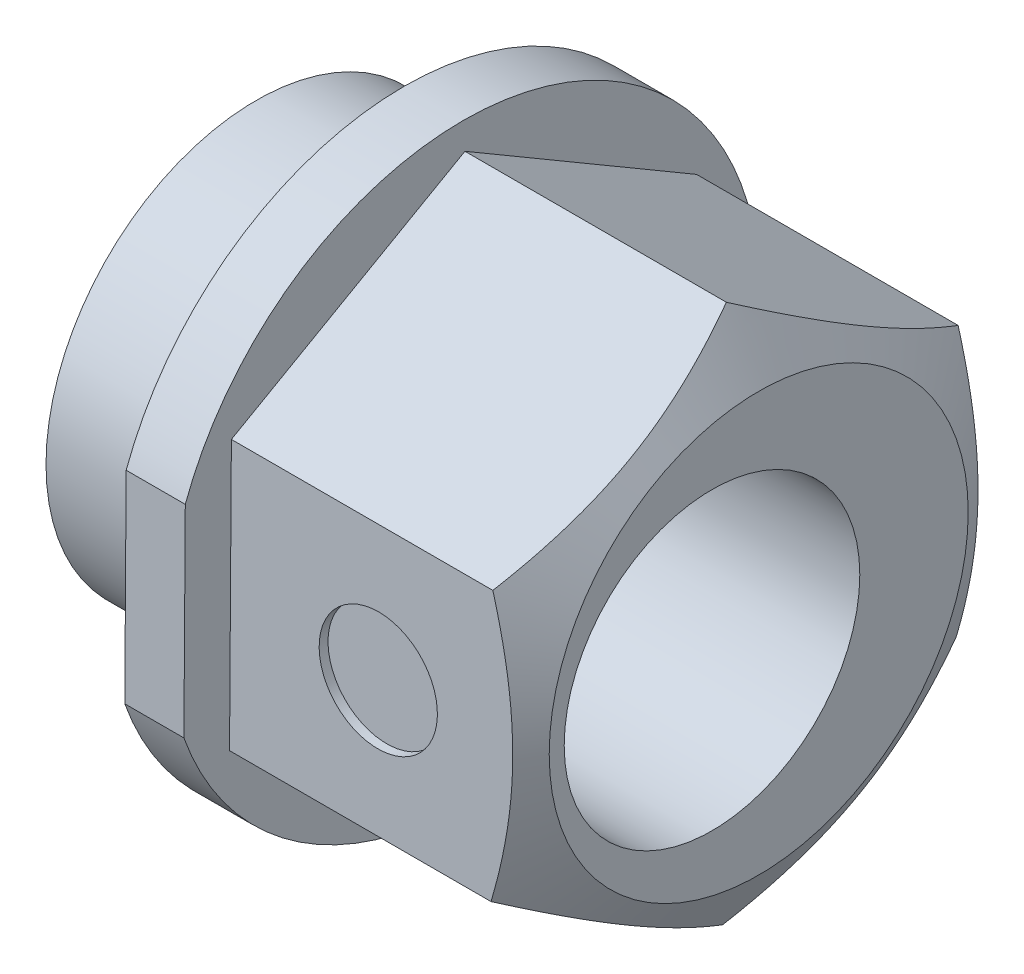
ISO-10303-21;
HEADER;
FILE_DESCRIPTION(('STEP AP214'),'2;1');
FILE_NAME('part.step','',(''),(''),'','','');
FILE_SCHEMA(('AUTOMOTIVE_DESIGN { 1 0 10303 214 1 1 1 1 }'));
ENDSEC;
DATA;
#1=APPLICATION_CONTEXT('core data for automotive mechanical design processes');
#2=APPLICATION_PROTOCOL_DEFINITION('international standard','automotive_design',2000,#1);
#3=PRODUCT_CONTEXT('',#1,'mechanical');
#4=PRODUCT('Part','Part','',(#3));
#5=PRODUCT_RELATED_PRODUCT_CATEGORY('part','',(#4));
#6=PRODUCT_DEFINITION_FORMATION('','',#4);
#7=PRODUCT_DEFINITION_CONTEXT('part definition',#1,'design');
#8=PRODUCT_DEFINITION('design','',#6,#7);
#9=PRODUCT_DEFINITION_SHAPE('','',#8);
#10=(LENGTH_UNIT() NAMED_UNIT(*) SI_UNIT(.MILLI.,.METRE.));
#11=(NAMED_UNIT(*) PLANE_ANGLE_UNIT() SI_UNIT($,.RADIAN.));
#12=(NAMED_UNIT(*) SI_UNIT($,.STERADIAN.) SOLID_ANGLE_UNIT());
#13=UNCERTAINTY_MEASURE_WITH_UNIT(LENGTH_MEASURE(1.E-05),#10,'distance_accuracy_value','');
#14=(GEOMETRIC_REPRESENTATION_CONTEXT(3) GLOBAL_UNCERTAINTY_ASSIGNED_CONTEXT((#13)) GLOBAL_UNIT_ASSIGNED_CONTEXT((#10,
#11,#12)) REPRESENTATION_CONTEXT('',''));
#15=CARTESIAN_POINT('',(0.,0.,0.));
#16=DIRECTION('',(0.,0.,1.));
#17=DIRECTION('',(1.,0.,0.));
#18=AXIS2_PLACEMENT_3D('',#15,#16,#17);
#19=CARTESIAN_POINT('',(5.,-4.54364126029758,0.0309423828233433));
#20=DIRECTION('',(0.,0.869410264297968,0.494090874569989));
#21=DIRECTION('',(0.,-0.494090874569989,0.869410264297968));
#22=AXIS2_PLACEMENT_3D('',#19,#20,#21);
#23=PLANE('',#22);
#24=DIRECTION('',(0.,0.494090874569989,-0.869410264297968));
#25=VECTOR('',#24,1.);
#26=CARTESIAN_POINT('',(4.42264973081037,-4.54364126029758,0.0309423828233433));
#27=LINE('',#26,#25);
#28=CARTESIAN_POINT('',(4.42264973081037,-4.54364126029758,0.0309423828233433));
#29=VERTEX_POINT('',#28);
#30=CARTESIAN_POINT('',(4.42264973081037,-4.54353714360121,0.0307591774067414));
#31=VERTEX_POINT('',#30);
#32=EDGE_CURVE('E233',#29,#31,#27,.T.);
#33=ORIENTED_EDGE('',*,*,#32,.F.);
#34=DIRECTION('',(-1.,0.,0.));
#35=VECTOR('',#34,1.);
#36=CARTESIAN_POINT('',(5.,-4.54364126029758,0.0309423828233433));
#37=LINE('',#36,#35);
#38=CARTESIAN_POINT('',(0.,-4.54364126029758,0.0309423828233433));
#39=VERTEX_POINT('',#38);
#40=EDGE_CURVE('E56',#29,#39,#37,.T.);
#41=ORIENTED_EDGE('',*,*,#40,.T.);
#42=DIRECTION('',(0.,0.494090874569989,-0.869410264297968));
#43=VECTOR('',#42,1.);
#44=CARTESIAN_POINT('',(0.,-4.54364126029758,0.0309423828233433));
#45=LINE('',#44,#43);
#46=CARTESIAN_POINT('',(0.,-2.29861751972745,-3.91943756568916));
#47=VERTEX_POINT('',#46);
#48=EDGE_CURVE('E286',#39,#47,#45,.T.);
#49=ORIENTED_EDGE('',*,*,#48,.T.);
#50=DIRECTION('',(-1.,0.,0.));
#51=VECTOR('',#50,1.);
#52=CARTESIAN_POINT('',(5.,-2.29861751972745,-3.91943756568916));
#53=LINE('',#52,#51);
#54=CARTESIAN_POINT('',(4.42264973081037,-2.29861751972745,-3.91943756568916));
#55=VERTEX_POINT('',#54);
#56=EDGE_CURVE('E255',#55,#47,#53,.T.);
#57=ORIENTED_EDGE('',*,*,#56,.F.);
#58=CARTESIAN_POINT('',(4.42264973081037,-2.29872163642382,-3.91925436027257));
#59=VERTEX_POINT('',#58);
#60=EDGE_CURVE('E235',#59,#55,#27,.T.);
#61=ORIENTED_EDGE('',*,*,#60,.F.);
#62=CARTESIAN_POINT('',(4.42252249257501,-4.5437549214527,0.0311423828233432));
#63=CARTESIAN_POINT('',(4.48018446189932,-4.44509780626388,-0.14245626674864));
#64=CARTESIAN_POINT('',(4.53262583823013,-4.34558908849139,-0.317553409948927));
#65=CARTESIAN_POINT('',(4.62416259753298,-4.14484856970296,-0.670779661389111));
#66=CARTESIAN_POINT('',(4.66322559849631,-4.04361320191933,-0.848915045770918));
#67=CARTESIAN_POINT('',(4.72403259166471,-3.84239708311443,-1.20297817066354));
#68=CARTESIAN_POINT('',(4.74618129094458,-3.74244729091028,-1.3788514355409));
#69=CARTESIAN_POINT('',(4.7726217929783,-3.54207742961478,-1.73142547208403));
#70=CARTESIAN_POINT('',(4.77693549121705,-3.4416580887709,-1.90812496231382));
#71=CARTESIAN_POINT('',(4.76795954206539,-3.2540203419231,-2.23829536511916));
#72=CARTESIAN_POINT('',(4.75687379404681,-3.16677384146384,-2.39181571315104));
#73=CARTESIAN_POINT('',(4.72173908945207,-2.99284924852408,-2.69785622937647));
#74=CARTESIAN_POINT('',(4.69767813181348,-2.90617175757552,-2.85037533910474));
#75=CARTESIAN_POINT('',(4.6375278388602,-2.73188859059485,-3.15704680799033));
#76=CARTESIAN_POINT('',(4.60118353864082,-2.64430497189952,-3.31116035470246));
#77=CARTESIAN_POINT('',(4.51869636125273,-2.47044399379805,-3.61708893323339));
#78=CARTESIAN_POINT('',(4.47257286465198,-2.3841644071245,-3.76890788418783));
#79=CARTESIAN_POINT('',(4.42252249257501,-2.29850385857233,-3.91963756568916));
#80=B_SPLINE_CURVE_WITH_KNOTS('',3,(#62,#63,#64,#65,#66,#67,#68,#69,#70,#71,#72,#73,#74,#75,#76,
#77,#78,#79),.UNSPECIFIED.,.F.,.F.,(4,2,2,2,2,2,2,2,4),(0.,0.62374475376447,1.24898876839455,
1.85875839446027,2.46777920233101,2.99805711762561,3.52882634219932,4.07136862541339,
4.61284557540261),.UNSPECIFIED.);
#81=EDGE_CURVE('E206',#31,#59,#80,.T.);
#82=ORIENTED_EDGE('',*,*,#81,.F.);
#83=EDGE_LOOP('',(#33,#41,#49,#57,#61,#82));
#84=FACE_BOUND('',#83,.T.);
#85=ADVANCED_FACE('F33',(#84),#23,.F.);
#86=CARTESIAN_POINT('',(5.,-2.29861751972745,-3.91943756568916));
#87=DIRECTION('',(0.,0.00680988299330266,0.999976812477978));
#88=DIRECTION('',(0.,-0.999976812477978,0.00680988299330266));
#89=AXIS2_PLACEMENT_3D('',#86,#87,#88);
#90=PLANE('',#89);
#91=DIRECTION('',(0.,0.999976812477978,-0.00680988299330266));
#92=VECTOR('',#91,1.);
#93=CARTESIAN_POINT('',(4.42264973081037,-2.29861751972745,-3.91943756568916));
#94=LINE('',#93,#92);
#95=CARTESIAN_POINT('',(4.42264973081037,-2.29840680083438,-3.91943900069344));
#96=VERTEX_POINT('',#95);
#97=EDGE_CURVE('E278',#55,#96,#94,.T.);
#98=ORIENTED_EDGE('',*,*,#97,.F.);
#99=ORIENTED_EDGE('',*,*,#56,.T.);
#100=DIRECTION('',(0.,0.999976812477978,-0.00680988299330266));
#101=VECTOR('',#100,1.);
#102=CARTESIAN_POINT('',(0.,-2.29861751972745,-3.91943756568916));
#103=LINE('',#102,#101);
#104=CARTESIAN_POINT('',(0.,2.24502374057014,-3.95037994851252));
#105=VERTEX_POINT('',#104);
#106=EDGE_CURVE('E288',#47,#105,#103,.T.);
#107=ORIENTED_EDGE('',*,*,#106,.T.);
#108=DIRECTION('',(-1.,0.,0.));
#109=VECTOR('',#108,1.);
#110=CARTESIAN_POINT('',(5.,2.24502374057014,-3.95037994851252));
#111=LINE('',#110,#109);
#112=CARTESIAN_POINT('',(4.42264973081037,2.24502374057014,-3.95037994851252));
#113=VERTEX_POINT('',#112);
#114=EDGE_CURVE('E254',#113,#105,#111,.T.);
#115=ORIENTED_EDGE('',*,*,#114,.F.);
#116=CARTESIAN_POINT('',(4.42264973081037,2.24481302167709,-3.95037851350824));
#117=VERTEX_POINT('',#116);
#118=EDGE_CURVE('E284',#117,#113,#94,.T.);
#119=ORIENTED_EDGE('',*,*,#118,.F.);
#120=CARTESIAN_POINT('',(4.42253116393923,-2.29881751972745,-3.91943620368098));
#121=CARTESIAN_POINT('',(4.48019242109376,-2.09914862844113,-3.92079595699736));
#122=CARTESIAN_POINT('',(4.53263304097571,-1.89775620556925,-3.92216744763432));
#123=CARTESIAN_POINT('',(4.62416823027487,-1.49148410960518,-3.92493417722488));
#124=CARTESIAN_POINT('',(4.66323041867056,-1.28659721815591,-3.92632946533579));
#125=CARTESIAN_POINT('',(4.72403580545695,-0.879362597142384,-3.92910274976131));
#126=CARTESIAN_POINT('',(4.7461837060212,-0.677077522036007,-3.9304803193965));
#127=CARTESIAN_POINT('',(4.77262266428957,-0.271555653578224,-3.93324193990706));
#128=CARTESIAN_POINT('',(4.7769356168253,-0.0683203339816987,-3.93462598074609));
#129=CARTESIAN_POINT('',(4.76795848909764,0.311429419334814,-3.93721209209843));
#130=CARTESIAN_POINT('',(4.75687259675822,0.488000728290138,-3.93841454993441));
#131=CARTESIAN_POINT('',(4.72173828301706,0.839992996868361,-3.94081163168036));
#132=CARTESIAN_POINT('',(4.69767786210512,1.0154127392098,-3.94200624730059));
#133=CARTESIAN_POINT('',(4.63752924463345,1.36813062537292,-3.94440827053197));
#134=CARTESIAN_POINT('',(4.60118610472693,1.54538413189465,-3.94561537416128));
#135=CARTESIAN_POINT('',(4.51870168885514,1.89724759738147,-3.94801157875291));
#136=CARTESIAN_POINT('',(4.4725797912675,2.07186206350711,-3.94920071040918));
#137=CARTESIAN_POINT('',(4.42253116393924,2.24522374057014,-3.9503813105207));
#138=B_SPLINE_CURVE_WITH_KNOTS('',3,(#120,#121,#122,#123,#124,#125,#126,#127,#128,#129,#130,
#131,#132,#133,#134,#135,#136,#137),.UNSPECIFIED.,.F.,.F.,(4,2,2,2,2,2,2,2,4),(0.,
0.623742697095919,1.24898459873569,1.85875236464984,2.46777133481405,2.99803595794767,
3.52879184024593,4.07132007516257,4.6127830764867),.UNSPECIFIED.);
#139=EDGE_CURVE('E202',#96,#117,#138,.T.);
#140=ORIENTED_EDGE('',*,*,#139,.F.);
#141=EDGE_LOOP('',(#98,#99,#107,#115,#119,#140));
#142=FACE_BOUND('',#141,.T.);
#143=ADVANCED_FACE('F211',(#142),#90,.F.);
#144=CARTESIAN_POINT('',(5.,2.24502374057014,-3.95037994851252));
#145=DIRECTION('',(0.,-0.862600381304665,0.505885937907989));
#146=DIRECTION('',(0.,-0.505885937907989,-0.862600381304665));
#147=AXIS2_PLACEMENT_3D('',#144,#145,#146);
#148=PLANE('',#147);
#149=DIRECTION('',(0.,0.505885937907989,0.862600381304665));
#150=VECTOR('',#149,1.);
#151=CARTESIAN_POINT('',(4.42264973081037,2.24502374057014,-3.95037994851252));
#152=LINE('',#151,#150);
#153=CARTESIAN_POINT('',(4.42264973081037,2.24513034276683,-3.95019817810021));
#154=VERTEX_POINT('',#153);
#155=EDGE_CURVE('E315',#113,#154,#152,.T.);
#156=ORIENTED_EDGE('',*,*,#155,.F.);
#157=ORIENTED_EDGE('',*,*,#114,.T.);
#158=DIRECTION('',(0.,0.505885937907989,0.862600381304665));
#159=VECTOR('',#158,1.);
#160=CARTESIAN_POINT('',(0.,2.24502374057014,-3.95037994851252));
#161=LINE('',#160,#159);
#162=CARTESIAN_POINT('',(0.,4.54364126029758,-0.0309423828233572));
#163=VERTEX_POINT('',#162);
#164=EDGE_CURVE('E291',#105,#163,#161,.T.);
#165=ORIENTED_EDGE('',*,*,#164,.T.);
#166=DIRECTION('',(-1.,0.,0.));
#167=VECTOR('',#166,1.);
#168=CARTESIAN_POINT('',(5.,4.54364126029758,-0.0309423828233572));
#169=LINE('',#168,#167);
#170=CARTESIAN_POINT('',(4.42264973081037,4.54364126029758,-0.0309423828233572));
#171=VERTEX_POINT('',#170);
#172=EDGE_CURVE('E252',#171,#163,#169,.T.);
#173=ORIENTED_EDGE('',*,*,#172,.F.);
#174=CARTESIAN_POINT('',(4.42264973081037,4.54353465810088,-0.0311241532356663));
#175=VERTEX_POINT('',#174);
#176=EDGE_CURVE('E312',#175,#171,#152,.T.);
#177=ORIENTED_EDGE('',*,*,#176,.F.);
#178=CARTESIAN_POINT('',(4.42252196827759,2.24490644733706,-3.95057994851252));
#179=CARTESIAN_POINT('',(4.48018398066162,2.3459187458398,-3.77834102927067));
#180=CARTESIAN_POINT('',(4.53262540272938,2.4478029766998,-3.60461535357349));
#181=CARTESIAN_POINT('',(4.62416225695894,2.65333565707971,-3.25415578318208));
#182=CARTESIAN_POINT('',(4.66322530705233,2.75698775852406,-3.07741566148852));
#183=CARTESIAN_POINT('',(4.72403239734704,2.96300739344096,-2.72612577118149));
#184=CARTESIAN_POINT('',(4.74618114491948,3.06534322897132,-2.55163005162331));
#185=CARTESIAN_POINT('',(4.77262174029362,3.27049640538847,-2.20181758414277));
#186=CARTESIAN_POINT('',(4.77693548361973,3.37331300063907,-2.02650210762572));
#187=CARTESIAN_POINT('',(4.76795960572909,3.56543023890256,-1.6989175859713));
#188=CARTESIAN_POINT('',(4.75687386643724,3.65475964657023,-1.54659949340975));
#189=CARTESIAN_POINT('',(4.72173913821122,3.83283648365142,-1.2429556558226));
#190=CARTESIAN_POINT('',(4.69767814812076,3.92158329716872,-1.091630960979));
#191=CARTESIAN_POINT('',(4.637527753863,4.10002727102906,-0.787361108114567));
#192=CARTESIAN_POINT('',(4.60118338348752,4.18970184735669,-0.634454458735401));
#193=CARTESIAN_POINT('',(4.51869603912955,4.36771355264578,-0.330921679203984));
#194=CARTESIAN_POINT('',(4.47257244584746,4.45605296206122,-0.180291660585353));
#195=CARTESIAN_POINT('',(4.42252196827759,4.54375855353066,-0.0307423828233574));
#196=B_SPLINE_CURVE_WITH_KNOTS('',3,(#178,#179,#180,#181,#182,#183,#184,#185,#186,#187,#188,
#189,#190,#191,#192,#193,#194,#195),.UNSPECIFIED.,.F.,.F.,(4,2,2,2,2,2,2,2,4),(0.,
0.623744878116952,1.2489890205049,1.85875875904113,2.46777967802528,2.99805839700006,
3.5288284282841,4.07137156089731,4.61284935426144),.UNSPECIFIED.);
#197=EDGE_CURVE('E163',#154,#175,#196,.T.);
#198=ORIENTED_EDGE('',*,*,#197,.F.);
#199=EDGE_LOOP('',(#156,#157,#165,#173,#177,#198));
#200=FACE_BOUND('',#199,.T.);
#201=ADVANCED_FACE('F214',(#200),#148,.F.);
#202=CARTESIAN_POINT('',(5.,4.54364126029758,-0.0309423828233572));
#203=DIRECTION('',(0.,-0.869410264297968,-0.494090874569989));
#204=DIRECTION('',(0.,0.494090874569989,-0.869410264297969));
#205=AXIS2_PLACEMENT_3D('',#202,#203,#204);
#206=PLANE('',#205);
#207=DIRECTION('',(0.,-0.494090874569989,0.869410264297969));
#208=VECTOR('',#207,1.);
#209=CARTESIAN_POINT('',(4.42264973081037,4.54364126029758,-0.0309423828233572));
#210=LINE('',#209,#208);
#211=CARTESIAN_POINT('',(4.42264973081037,4.54353714360121,-0.0307591774067664));
#212=VERTEX_POINT('',#211);
#213=EDGE_CURVE('E308',#171,#212,#210,.T.);
#214=ORIENTED_EDGE('',*,*,#213,.F.);
#215=ORIENTED_EDGE('',*,*,#172,.T.);
#216=DIRECTION('',(0.,-0.494090874569989,0.869410264297968));
#217=VECTOR('',#216,1.);
#218=CARTESIAN_POINT('',(0.,4.54364126029758,-0.0309423828233572));
#219=LINE('',#218,#217);
#220=CARTESIAN_POINT('',(0.,2.29861751972744,3.91943756568916));
#221=VERTEX_POINT('',#220);
#222=EDGE_CURVE('E300',#163,#221,#219,.T.);
#223=ORIENTED_EDGE('',*,*,#222,.T.);
#224=DIRECTION('',(-1.,0.,0.));
#225=VECTOR('',#224,1.);
#226=CARTESIAN_POINT('',(5.,2.29861751972744,3.91943756568916));
#227=LINE('',#226,#225);
#228=CARTESIAN_POINT('',(4.42264973081037,2.29861751972744,3.91943756568916));
#229=VERTEX_POINT('',#228);
#230=EDGE_CURVE('E245',#229,#221,#227,.T.);
#231=ORIENTED_EDGE('',*,*,#230,.F.);
#232=CARTESIAN_POINT('',(4.42264973081037,2.2987216364238,3.91925436027258));
#233=VERTEX_POINT('',#232);
#234=EDGE_CURVE('E140',#233,#229,#210,.T.);
#235=ORIENTED_EDGE('',*,*,#234,.F.);
#236=CARTESIAN_POINT('',(4.42252249257501,4.5437549214527,-0.031142382823357));
#237=CARTESIAN_POINT('',(4.48018446189932,4.44509780626387,0.142456266748626));
#238=CARTESIAN_POINT('',(4.53262583823013,4.34558908849138,0.317553409948912));
#239=CARTESIAN_POINT('',(4.62416259753299,4.14484856970295,0.670779661389096));
#240=CARTESIAN_POINT('',(4.66322559849632,4.04361320191932,0.848915045770903));
#241=CARTESIAN_POINT('',(4.72403259166472,3.84239708311442,1.20297817066352));
#242=CARTESIAN_POINT('',(4.74618129094458,3.74244729091027,1.37885143554089));
#243=CARTESIAN_POINT('',(4.7726217929783,3.54207742961477,1.73142547208402));
#244=CARTESIAN_POINT('',(4.77693549121706,3.44165808877089,1.9081249623138));
#245=CARTESIAN_POINT('',(4.7679595420654,3.2540203419231,2.23829536511915));
#246=CARTESIAN_POINT('',(4.75687379404682,3.16677384146383,2.39181571315103));
#247=CARTESIAN_POINT('',(4.72173908945208,2.99284924852407,2.69785622937646));
#248=CARTESIAN_POINT('',(4.69767813181348,2.90617175757551,2.85037533910473));
#249=CARTESIAN_POINT('',(4.6375278388602,2.73188859059484,3.15704680799032));
#250=CARTESIAN_POINT('',(4.60118353864083,2.64430497189951,3.31116035470246));
#251=CARTESIAN_POINT('',(4.51869636125274,2.47044399379804,3.61708893323339));
#252=CARTESIAN_POINT('',(4.47257286465199,2.38416440712448,3.76890788418783));
#253=CARTESIAN_POINT('',(4.42252249257501,2.29850385857232,3.91963756568916));
#254=B_SPLINE_CURVE_WITH_KNOTS('',3,(#236,#237,#238,#239,#240,#241,#242,#243,#244,#245,#246,
#247,#248,#249,#250,#251,#252,#253),.UNSPECIFIED.,.F.,.F.,(4,2,2,2,2,2,2,2,4),(0.,
0.623744753764468,1.24898876839455,1.85875839446027,2.46777920233101,2.99805711762561,
3.52882634219932,4.0713686254134,4.61284557540263),.UNSPECIFIED.);
#255=EDGE_CURVE('E153',#212,#233,#254,.T.);
#256=ORIENTED_EDGE('',*,*,#255,.F.);
#257=EDGE_LOOP('',(#214,#215,#223,#231,#235,#256));
#258=FACE_BOUND('',#257,.T.);
#259=ADVANCED_FACE('F218',(#258),#206,.F.);
#260=CARTESIAN_POINT('',(5.,2.29861751972744,3.91943756568916));
#261=DIRECTION('',(0.,-0.00680988299330344,-0.999976812477978));
#262=DIRECTION('',(0.,0.999976812477978,-0.00680988299330344));
#263=AXIS2_PLACEMENT_3D('',#260,#261,#262);
#264=PLANE('',#263);
#265=CARTESIAN_POINT('',(2.5,0.0267968895786494,3.93490875710084));
#266=DIRECTION('',(0.,-0.00680988299330344,-0.999976812477978));
#267=DIRECTION('',(0.,0.999976812477978,-0.00680988299330344));
#268=AXIS2_PLACEMENT_3D('',#265,#266,#267);
#269=CIRCLE('',#268,0.999999999999998);
#270=CARTESIAN_POINT('',(2.5,1.02677370205663,3.92809887410754));
#271=VERTEX_POINT('',#270);
#272=EDGE_CURVE('E322',#271,#271,#269,.T.);
#273=ORIENTED_EDGE('',*,*,#272,.T.);
#274=EDGE_LOOP('',(#273));
#275=FACE_BOUND('',#274,.T.);
#276=DIRECTION('',(0.,-0.999976812477978,0.00680988299330344));
#277=VECTOR('',#276,1.);
#278=CARTESIAN_POINT('',(4.42264973081037,2.29861751972744,3.91943756568916));
#279=LINE('',#278,#277);
#280=CARTESIAN_POINT('',(4.42264973081037,2.29840680083438,3.91943900069344));
#281=VERTEX_POINT('',#280);
#282=EDGE_CURVE('E135',#229,#281,#279,.T.);
#283=ORIENTED_EDGE('',*,*,#282,.F.);
#284=ORIENTED_EDGE('',*,*,#230,.T.);
#285=DIRECTION('',(0.,-0.999976812477978,0.00680988299330344));
#286=VECTOR('',#285,1.);
#287=CARTESIAN_POINT('',(0.,2.29861751972744,3.91943756568916));
#288=LINE('',#287,#286);
#289=CARTESIAN_POINT('',(0.,-2.24502374057014,3.95037994851252));
#290=VERTEX_POINT('',#289);
#291=EDGE_CURVE('E247',#221,#290,#288,.T.);
#292=ORIENTED_EDGE('',*,*,#291,.T.);
#293=DIRECTION('',(-1.,0.,0.));
#294=VECTOR('',#293,1.);
#295=CARTESIAN_POINT('',(5.,-2.24502374057014,3.95037994851252));
#296=LINE('',#295,#294);
#297=CARTESIAN_POINT('',(4.42264973081037,-2.24502374057014,3.95037994851252));
#298=VERTEX_POINT('',#297);
#299=EDGE_CURVE('E243',#298,#290,#296,.T.);
#300=ORIENTED_EDGE('',*,*,#299,.F.);
#301=CARTESIAN_POINT('',(4.42264973081037,-2.24481302167709,3.95037851350824));
#302=VERTEX_POINT('',#301);
#303=EDGE_CURVE('E144',#302,#298,#279,.T.);
#304=ORIENTED_EDGE('',*,*,#303,.F.);
#305=CARTESIAN_POINT('',(4.42253116393924,2.29881751972744,3.91943620368098));
#306=CARTESIAN_POINT('',(4.48019242109376,2.09914862844111,3.92079595699735));
#307=CARTESIAN_POINT('',(4.53263304097571,1.89775620556923,3.92216744763432));
#308=CARTESIAN_POINT('',(4.62416823027487,1.49148410960517,3.92493417722488));
#309=CARTESIAN_POINT('',(4.66323041867057,1.2865972181559,3.92632946533578));
#310=CARTESIAN_POINT('',(4.72403580545695,0.879362597142373,3.9291027497613));
#311=CARTESIAN_POINT('',(4.7461837060212,0.677077522035996,3.9304803193965));
#312=CARTESIAN_POINT('',(4.77262266428957,0.271555653578214,3.93324193990705));
#313=CARTESIAN_POINT('',(4.7769356168253,0.0683203339816892,3.93462598074609));
#314=CARTESIAN_POINT('',(4.76795848909764,-0.311429419334823,3.93721209209843));
#315=CARTESIAN_POINT('',(4.75687259675822,-0.488000728290145,3.9384145499344));
#316=CARTESIAN_POINT('',(4.72173828301706,-0.839992996868366,3.94081163168035));
#317=CARTESIAN_POINT('',(4.69767786210512,-1.0154127392098,3.94200624730059));
#318=CARTESIAN_POINT('',(4.63752924463345,-1.36813062537293,3.94440827053197));
#319=CARTESIAN_POINT('',(4.60118610472693,-1.54538413189465,3.94561537416128));
#320=CARTESIAN_POINT('',(4.51870168885514,-1.89724759738148,3.94801157875291));
#321=CARTESIAN_POINT('',(4.4725797912675,-2.07186206350711,3.94920071040918));
#322=CARTESIAN_POINT('',(4.42253116393924,-2.24522374057014,3.9503813105207));
#323=B_SPLINE_CURVE_WITH_KNOTS('',3,(#305,#306,#307,#308,#309,#310,#311,#312,#313,#314,#315,
#316,#317,#318,#319,#320,#321,#322),.UNSPECIFIED.,.F.,.F.,(4,2,2,2,2,2,2,2,4),(0.,
0.623742697095919,1.24898459873569,1.85875236464984,2.46777133481404,2.99803595794766,
3.52879184024592,4.07132007516255,4.61278307648668),.UNSPECIFIED.);
#324=EDGE_CURVE('E149',#281,#302,#323,.T.);
#325=ORIENTED_EDGE('',*,*,#324,.F.);
#326=EDGE_LOOP('',(#283,#284,#292,#300,#304,#325));
#327=FACE_BOUND('',#326,.T.);
#328=ADVANCED_FACE('F159',(#275,#327),#264,.F.);
#329=CARTESIAN_POINT('',(5.,-2.24502374057014,3.95037994851252));
#330=DIRECTION('',(0.,0.862600381304665,-0.50588593790799));
#331=DIRECTION('',(0.,0.50588593790799,0.862600381304665));
#332=AXIS2_PLACEMENT_3D('',#329,#330,#331);
#333=PLANE('',#332);
#334=DIRECTION('',(0.,-0.50588593790799,-0.862600381304665));
#335=VECTOR('',#334,1.);
#336=CARTESIAN_POINT('',(4.42264973081037,-2.24502374057014,3.95037994851252));
#337=LINE('',#336,#335);
#338=CARTESIAN_POINT('',(4.42264973081037,-2.24513034276683,3.95019817810021));
#339=VERTEX_POINT('',#338);
#340=EDGE_CURVE('E11',#298,#339,#337,.T.);
#341=ORIENTED_EDGE('',*,*,#340,.F.);
#342=ORIENTED_EDGE('',*,*,#299,.T.);
#343=DIRECTION('',(0.,-0.50588593790799,-0.862600381304665));
#344=VECTOR('',#343,1.);
#345=CARTESIAN_POINT('',(0.,-2.24502374057014,3.95037994851252));
#346=LINE('',#345,#344);
#347=EDGE_CURVE('E242',#290,#39,#346,.T.);
#348=ORIENTED_EDGE('',*,*,#347,.T.);
#349=ORIENTED_EDGE('',*,*,#40,.F.);
#350=CARTESIAN_POINT('',(4.42264973081037,-4.54353465810088,0.0311241532356655));
#351=VERTEX_POINT('',#350);
#352=EDGE_CURVE('E37',#351,#29,#337,.T.);
#353=ORIENTED_EDGE('',*,*,#352,.F.);
#354=CARTESIAN_POINT('',(4.42252196827759,-2.24490644733706,3.95057994851252));
#355=CARTESIAN_POINT('',(4.48018398066162,-2.34591874583979,3.77834102927067));
#356=CARTESIAN_POINT('',(4.53262540272938,-2.44780297669979,3.60461535357349));
#357=CARTESIAN_POINT('',(4.62416225695894,-2.65333565707971,3.25415578318208));
#358=CARTESIAN_POINT('',(4.66322530705233,-2.75698775852406,3.07741566148852));
#359=CARTESIAN_POINT('',(4.72403239734704,-2.96300739344096,2.72612577118149));
#360=CARTESIAN_POINT('',(4.74618114491948,-3.06534322897131,2.55163005162331));
#361=CARTESIAN_POINT('',(4.77262174029362,-3.27049640538847,2.20181758414277));
#362=CARTESIAN_POINT('',(4.77693548361973,-3.37331300063907,2.02650210762572));
#363=CARTESIAN_POINT('',(4.76795960572909,-3.56543023890256,1.6989175859713));
#364=CARTESIAN_POINT('',(4.75687386643724,-3.65475964657023,1.54659949340975));
#365=CARTESIAN_POINT('',(4.72173913821122,-3.83283648365142,1.2429556558226));
#366=CARTESIAN_POINT('',(4.69767814812076,-3.92158329716872,1.09163096097899));
#367=CARTESIAN_POINT('',(4.637527753863,-4.10002727102906,0.787361108114559));
#368=CARTESIAN_POINT('',(4.60118338348752,-4.18970184735669,0.634454458735392));
#369=CARTESIAN_POINT('',(4.51869603912955,-4.36771355264579,0.330921679203973));
#370=CARTESIAN_POINT('',(4.47257244584746,-4.45605296206122,0.180291660585341));
#371=CARTESIAN_POINT('',(4.42252196827758,-4.54375855353067,0.0307423828233436));
#372=B_SPLINE_CURVE_WITH_KNOTS('',3,(#354,#355,#356,#357,#358,#359,#360,#361,#362,#363,#364,
#365,#366,#367,#368,#369,#370,#371),.UNSPECIFIED.,.F.,.F.,(4,2,2,2,2,2,2,2,4),(0.,
0.62374487811695,1.2489890205049,1.85875875904113,2.46777967802528,2.99805839700006,
3.52882842828411,4.07137156089732,4.61284935426146),.UNSPECIFIED.);
#373=EDGE_CURVE('E161',#339,#351,#372,.T.);
#374=ORIENTED_EDGE('',*,*,#373,.F.);
#375=EDGE_LOOP('',(#341,#342,#348,#349,#353,#374));
#376=FACE_BOUND('',#375,.T.);
#377=ADVANCED_FACE('F226',(#376),#333,.F.);
#378=CARTESIAN_POINT('',(5.,0.,0.));
#379=DIRECTION('',(1.,0.,0.));
#380=DIRECTION('',(0.,0.,-1.));
#381=AXIS2_PLACEMENT_3D('',#378,#379,#380);
#382=PLANE('',#381);
#383=CARTESIAN_POINT('',(5.,0.,0.79));
#384=DIRECTION('',(-1.,0.,0.));
#385=DIRECTION('',(0.,0.,1.));
#386=AXIS2_PLACEMENT_3D('',#383,#384,#385);
#387=CIRCLE('',#386,2.5);
#388=CARTESIAN_POINT('',(5.,0.,3.29));
#389=VERTEX_POINT('',#388);
#390=EDGE_CURVE('E319',#389,#389,#387,.T.);
#391=ORIENTED_EDGE('',*,*,#390,.T.);
#392=EDGE_LOOP('',(#391));
#393=FACE_BOUND('',#392,.T.);
#394=CARTESIAN_POINT('',(5.,0.,0.));
#395=DIRECTION('',(-1.,0.,0.));
#396=DIRECTION('',(0.,0.,1.));
#397=AXIS2_PLACEMENT_3D('',#394,#395,#396);
#398=CIRCLE('',#397,3.54364126029758);
#399=CARTESIAN_POINT('',(5.,0.,3.54364126029758));
#400=VERTEX_POINT('',#399);
#401=EDGE_CURVE('E154',#400,#400,#398,.T.);
#402=ORIENTED_EDGE('',*,*,#401,.F.);
#403=EDGE_LOOP('',(#402));
#404=FACE_BOUND('',#403,.T.);
#405=ADVANCED_FACE('F373',(#393,#404),#382,.T.);
#406=CARTESIAN_POINT('',(0.,0.,0.));
#407=DIRECTION('',(-1.,0.,0.));
#408=DIRECTION('',(0.,0.,1.));
#409=AXIS2_PLACEMENT_3D('',#406,#407,#408);
#410=PLANE('',#409);
#411=CARTESIAN_POINT('',(0.,0.,0.));
#412=DIRECTION('',(-1.,0.,0.));
#413=DIRECTION('',(0.,0.,1.));
#414=AXIS2_PLACEMENT_3D('',#411,#412,#413);
#415=CIRCLE('',#414,5.01);
#416=CARTESIAN_POINT('',(0.,1.73708093898426,4.69921799998868));
#417=VERTEX_POINT('',#416);
#418=CARTESIAN_POINT('',(0.,-1.67291906101574,4.72244023946203));
#419=VERTEX_POINT('',#418);
#420=EDGE_CURVE('E334',#417,#419,#415,.T.);
#421=ORIENTED_EDGE('',*,*,#420,.F.);
#422=DIRECTION('',(0.,0.999976812477978,-0.0068098829933025));
#423=VECTOR('',#422,1.);
#424=CARTESIAN_POINT('',(0.,1.73708093898426,4.69921799998868));
#425=LINE('',#424,#423);
#426=EDGE_CURVE('E341',#419,#417,#425,.T.);
#427=ORIENTED_EDGE('',*,*,#426,.F.);
#428=EDGE_LOOP('',(#421,#427));
#429=FACE_BOUND('',#428,.T.);
#430=ORIENTED_EDGE('',*,*,#106,.F.);
#431=ORIENTED_EDGE('',*,*,#48,.F.);
#432=ORIENTED_EDGE('',*,*,#347,.F.);
#433=ORIENTED_EDGE('',*,*,#291,.F.);
#434=ORIENTED_EDGE('',*,*,#222,.F.);
#435=ORIENTED_EDGE('',*,*,#164,.F.);
#436=EDGE_LOOP('',(#430,#431,#432,#433,#434,#435));
#437=FACE_BOUND('',#436,.T.);
#438=ADVANCED_FACE('F305',(#429,#437),#410,.F.);
#439=CARTESIAN_POINT('',(-1.,0.,0.));
#440=DIRECTION('',(1.,0.,0.));
#441=DIRECTION('',(0.,0.,-1.));
#442=AXIS2_PLACEMENT_3D('',#439,#440,#441);
#443=CYLINDRICAL_SURFACE('',#442,5.01);
#444=ORIENTED_EDGE('',*,*,#420,.T.);
#445=DIRECTION('',(1.,0.,0.));
#446=VECTOR('',#445,1.);
#447=CARTESIAN_POINT('',(-1.,-1.67291906101574,4.72244023946203));
#448=LINE('',#447,#446);
#449=CARTESIAN_POINT('',(-1.,-1.67291906101574,4.72244023946203));
#450=VERTEX_POINT('',#449);
#451=EDGE_CURVE('E289',#450,#419,#448,.T.);
#452=ORIENTED_EDGE('',*,*,#451,.F.);
#453=CARTESIAN_POINT('',(-1.,0.,0.));
#454=DIRECTION('',(-1.,0.,0.));
#455=DIRECTION('',(0.,0.,1.));
#456=AXIS2_PLACEMENT_3D('',#453,#454,#455);
#457=CIRCLE('',#456,5.01);
#458=CARTESIAN_POINT('',(-1.,1.73708093898426,4.69921799998868));
#459=VERTEX_POINT('',#458);
#460=EDGE_CURVE('E337',#459,#450,#457,.T.);
#461=ORIENTED_EDGE('',*,*,#460,.F.);
#462=DIRECTION('',(1.,0.,0.));
#463=VECTOR('',#462,1.);
#464=CARTESIAN_POINT('',(-1.,1.73708093898426,4.69921799998868));
#465=LINE('',#464,#463);
#466=EDGE_CURVE('E294',#459,#417,#465,.T.);
#467=ORIENTED_EDGE('',*,*,#466,.T.);
#468=EDGE_LOOP('',(#444,#452,#461,#467));
#469=FACE_BOUND('',#468,.T.);
#470=ADVANCED_FACE('F350',(#469),#443,.T.);
#471=CARTESIAN_POINT('',(-1.,1.73708093898426,4.69921799998868));
#472=DIRECTION('',(0.,-0.0068098829933025,-0.999976812477978));
#473=DIRECTION('',(0.,0.999976812477978,-0.0068098829933025));
#474=AXIS2_PLACEMENT_3D('',#471,#472,#473);
#475=PLANE('',#474);
#476=ORIENTED_EDGE('',*,*,#426,.T.);
#477=ORIENTED_EDGE('',*,*,#466,.F.);
#478=DIRECTION('',(0.,0.999976812477978,-0.00680988299330402));
#479=VECTOR('',#478,1.);
#480=CARTESIAN_POINT('',(-1.,0.0320809389842552,4.71082911972535));
#481=LINE('',#480,#479);
#482=EDGE_CURVE('E340',#450,#459,#481,.T.);
#483=ORIENTED_EDGE('',*,*,#482,.F.);
#484=ORIENTED_EDGE('',*,*,#451,.T.);
#485=EDGE_LOOP('',(#476,#477,#483,#484));
#486=FACE_BOUND('',#485,.T.);
#487=ADVANCED_FACE('F354',(#486),#475,.F.);
#488=CARTESIAN_POINT('',(-1.,0.,0.));
#489=DIRECTION('',(-1.,0.,0.));
#490=DIRECTION('',(0.,0.,1.));
#491=AXIS2_PLACEMENT_3D('',#488,#489,#490);
#492=PLANE('',#491);
#493=CARTESIAN_POINT('',(-1.,0.,0.));
#494=DIRECTION('',(-1.,0.,0.));
#495=DIRECTION('',(0.,0.,1.));
#496=AXIS2_PLACEMENT_3D('',#493,#494,#495);
#497=CIRCLE('',#496,3.555);
#498=CARTESIAN_POINT('',(-1.,0.,3.555));
#499=VERTEX_POINT('',#498);
#500=EDGE_CURVE('E328',#499,#499,#497,.T.);
#501=ORIENTED_EDGE('',*,*,#500,.F.);
#502=EDGE_LOOP('',(#501));
#503=FACE_BOUND('',#502,.T.);
#504=ORIENTED_EDGE('',*,*,#460,.T.);
#505=ORIENTED_EDGE('',*,*,#482,.T.);
#506=EDGE_LOOP('',(#504,#505));
#507=FACE_BOUND('',#506,.T.);
#508=ADVANCED_FACE('F356',(#503,#507),#492,.T.);
#509=CARTESIAN_POINT('',(-3.5,0.,0.));
#510=DIRECTION('',(1.,0.,0.));
#511=DIRECTION('',(0.,0.,-1.));
#512=AXIS2_PLACEMENT_3D('',#509,#510,#511);
#513=CYLINDRICAL_SURFACE('',#512,3.555);
#514=CARTESIAN_POINT('',(-3.5,0.,0.));
#515=DIRECTION('',(-1.,0.,0.));
#516=DIRECTION('',(0.,0.,1.));
#517=AXIS2_PLACEMENT_3D('',#514,#515,#516);
#518=CIRCLE('',#517,3.555);
#519=CARTESIAN_POINT('',(-3.5,0.,3.555));
#520=VERTEX_POINT('',#519);
#521=EDGE_CURVE('E331',#520,#520,#518,.T.);
#522=ORIENTED_EDGE('',*,*,#521,.F.);
#523=EDGE_LOOP('',(#522));
#524=FACE_BOUND('',#523,.T.);
#525=ORIENTED_EDGE('',*,*,#500,.T.);
#526=EDGE_LOOP('',(#525));
#527=FACE_BOUND('',#526,.T.);
#528=ADVANCED_FACE('F358',(#524,#527),#513,.T.);
#529=CARTESIAN_POINT('',(-3.5,0.,0.));
#530=DIRECTION('',(-1.,0.,0.));
#531=DIRECTION('',(0.,0.,1.));
#532=AXIS2_PLACEMENT_3D('',#529,#530,#531);
#533=PLANE('',#532);
#534=CARTESIAN_POINT('',(-3.5,0.,0.79));
#535=DIRECTION('',(-1.,0.,0.));
#536=DIRECTION('',(0.,0.,1.));
#537=AXIS2_PLACEMENT_3D('',#534,#535,#536);
#538=CIRCLE('',#537,2.5);
#539=CARTESIAN_POINT('',(-3.5,0.,3.29));
#540=VERTEX_POINT('',#539);
#541=EDGE_CURVE('E281',#540,#540,#538,.T.);
#542=ORIENTED_EDGE('',*,*,#541,.F.);
#543=EDGE_LOOP('',(#542));
#544=FACE_BOUND('',#543,.T.);
#545=ORIENTED_EDGE('',*,*,#521,.T.);
#546=EDGE_LOOP('',(#545));
#547=FACE_BOUND('',#546,.T.);
#548=ADVANCED_FACE('F365',(#544,#547),#533,.T.);
#549=CARTESIAN_POINT('',(2.5,0.0257754071296538,3.78491223522914));
#550=DIRECTION('',(0.,0.00680988299330344,0.999976812477978));
#551=DIRECTION('',(0.,-0.999976812477978,0.00680988299330344));
#552=AXIS2_PLACEMENT_3D('',#549,#550,#551);
#553=CYLINDRICAL_SURFACE('',#552,0.999999999999998);
#554=CARTESIAN_POINT('',(2.5,0.0257754071296538,3.78491223522914));
#555=DIRECTION('',(0.,-0.00680988299330344,-0.999976812477978));
#556=DIRECTION('',(0.,0.999976812477978,-0.00680988299330344));
#557=AXIS2_PLACEMENT_3D('',#554,#555,#556);
#558=CIRCLE('',#557,0.999999999999998);
#559=CARTESIAN_POINT('',(2.5,1.02575221960763,3.77810235223584));
#560=VERTEX_POINT('',#559);
#561=EDGE_CURVE('E325',#560,#560,#558,.T.);
#562=ORIENTED_EDGE('',*,*,#561,.T.);
#563=EDGE_LOOP('',(#562));
#564=FACE_BOUND('',#563,.T.);
#565=ORIENTED_EDGE('',*,*,#272,.F.);
#566=EDGE_LOOP('',(#565));
#567=FACE_BOUND('',#566,.T.);
#568=ADVANCED_FACE('F419',(#564,#567),#553,.F.);
#569=CARTESIAN_POINT('',(2.5,0.0257754071296538,3.78491223522914));
#570=DIRECTION('',(0.,-0.00680988299330344,-0.999976812477978));
#571=DIRECTION('',(0.,0.999976812477978,-0.00680988299330344));
#572=AXIS2_PLACEMENT_3D('',#569,#570,#571);
#573=PLANE('',#572);
#574=ORIENTED_EDGE('',*,*,#561,.F.);
#575=EDGE_LOOP('',(#574));
#576=FACE_BOUND('',#575,.T.);
#577=ADVANCED_FACE('F275',(#576),#573,.F.);
#578=CARTESIAN_POINT('',(5.,0.,0.79));
#579=DIRECTION('',(-1.,0.,0.));
#580=DIRECTION('',(0.,0.,1.));
#581=AXIS2_PLACEMENT_3D('',#578,#579,#580);
#582=CYLINDRICAL_SURFACE('',#581,2.5);
#583=ORIENTED_EDGE('',*,*,#390,.F.);
#584=EDGE_LOOP('',(#583));
#585=FACE_BOUND('',#584,.T.);
#586=ORIENTED_EDGE('',*,*,#541,.T.);
#587=EDGE_LOOP('',(#586));
#588=FACE_BOUND('',#587,.T.);
#589=ADVANCED_FACE('F189',(#585,#588),#582,.F.);
#590=CARTESIAN_POINT('',(4.42264973081037,8.54364126029758,0.));
#591=DIRECTION('',(1.,0.,0.));
#592=DIRECTION('',(0.,0.,-1.));
#593=AXIS2_PLACEMENT_3D('',#590,#591,#592);
#594=PLANE('',#593);
#595=ORIENTED_EDGE('',*,*,#60,.T.);
#596=ORIENTED_EDGE('',*,*,#97,.T.);
#597=CARTESIAN_POINT('',(4.42264973081037,0.,0.));
#598=DIRECTION('',(-1.,0.,0.));
#599=DIRECTION('',(0.,0.,1.));
#600=AXIS2_PLACEMENT_3D('',#597,#598,#599);
#601=CIRCLE('',#600,4.54364126029758);
#602=EDGE_CURVE('E280',#96,#59,#601,.T.);
#603=ORIENTED_EDGE('',*,*,#602,.T.);
#604=EDGE_LOOP('',(#595,#596,#603));
#605=FACE_BOUND('',#604,.T.);
#606=ADVANCED_FACE('F188',(#605),#594,.T.);
#607=ORIENTED_EDGE('',*,*,#118,.T.);
#608=ORIENTED_EDGE('',*,*,#155,.T.);
#609=EDGE_CURVE('E521',#154,#117,#601,.T.);
#610=ORIENTED_EDGE('',*,*,#609,.T.);
#611=EDGE_LOOP('',(#607,#608,#610));
#612=FACE_BOUND('',#611,.T.);
#613=ADVANCED_FACE('F267',(#612),#594,.T.);
#614=ORIENTED_EDGE('',*,*,#176,.T.);
#615=ORIENTED_EDGE('',*,*,#213,.T.);
#616=EDGE_CURVE('E155',#212,#175,#601,.T.);
#617=ORIENTED_EDGE('',*,*,#616,.T.);
#618=EDGE_LOOP('',(#614,#615,#617));
#619=FACE_BOUND('',#618,.T.);
#620=ADVANCED_FACE('F273',(#619),#594,.T.);
#621=ORIENTED_EDGE('',*,*,#234,.T.);
#622=ORIENTED_EDGE('',*,*,#282,.T.);
#623=EDGE_CURVE('E138',#281,#233,#601,.T.);
#624=ORIENTED_EDGE('',*,*,#623,.T.);
#625=EDGE_LOOP('',(#621,#622,#624));
#626=FACE_BOUND('',#625,.T.);
#627=ADVANCED_FACE('F137',(#626),#594,.T.);
#628=ORIENTED_EDGE('',*,*,#303,.T.);
#629=ORIENTED_EDGE('',*,*,#340,.T.);
#630=EDGE_CURVE('E157',#339,#302,#601,.T.);
#631=ORIENTED_EDGE('',*,*,#630,.T.);
#632=EDGE_LOOP('',(#628,#629,#631));
#633=FACE_BOUND('',#632,.T.);
#634=ADVANCED_FACE('F261',(#633),#594,.T.);
#635=ORIENTED_EDGE('',*,*,#32,.T.);
#636=EDGE_CURVE('E48',#31,#351,#601,.T.);
#637=ORIENTED_EDGE('',*,*,#636,.T.);
#638=ORIENTED_EDGE('',*,*,#352,.T.);
#639=EDGE_LOOP('',(#635,#637,#638));
#640=FACE_BOUND('',#639,.T.);
#641=ADVANCED_FACE('F186',(#640),#594,.T.);
#642=CARTESIAN_POINT('',(4.42264973081037,0.,0.));
#643=DIRECTION('',(-1.,0.,0.));
#644=DIRECTION('',(0.,0.,1.));
#645=AXIS2_PLACEMENT_3D('',#642,#643,#644);
#646=CONICAL_SURFACE('',#645,4.54364126029758,1.0471975511966);
#647=ORIENTED_EDGE('',*,*,#401,.T.);
#648=EDGE_LOOP('',(#647));
#649=FACE_BOUND('',#648,.T.);
#650=ORIENTED_EDGE('',*,*,#81,.T.);
#651=ORIENTED_EDGE('',*,*,#602,.F.);
#652=ORIENTED_EDGE('',*,*,#139,.T.);
#653=ORIENTED_EDGE('',*,*,#609,.F.);
#654=ORIENTED_EDGE('',*,*,#197,.T.);
#655=ORIENTED_EDGE('',*,*,#616,.F.);
#656=ORIENTED_EDGE('',*,*,#255,.T.);
#657=ORIENTED_EDGE('',*,*,#623,.F.);
#658=ORIENTED_EDGE('',*,*,#324,.T.);
#659=ORIENTED_EDGE('',*,*,#630,.F.);
#660=ORIENTED_EDGE('',*,*,#373,.T.);
#661=ORIENTED_EDGE('',*,*,#636,.F.);
#662=EDGE_LOOP('',(#650,#651,#652,#653,#654,#655,#656,#657,#658,#659,#660,#661));
#663=FACE_BOUND('',#662,.T.);
#664=ADVANCED_FACE('F147',(#649,#663),#646,.T.);
#665=CLOSED_SHELL('',(#85,#143,#201,#259,#328,#377,#405,#438,#470,#487,#508,#528,#548,#568,#577,
#589,#606,#613,#620,#627,#634,#641,#664));
#666=MANIFOLD_SOLID_BREP('B2',#665);
#667=ADVANCED_BREP_SHAPE_REPRESENTATION('',(#18,#666),#14);
#668=SHAPE_DEFINITION_REPRESENTATION(#9,#667);
ENDSEC;
END-ISO-10303-21;
